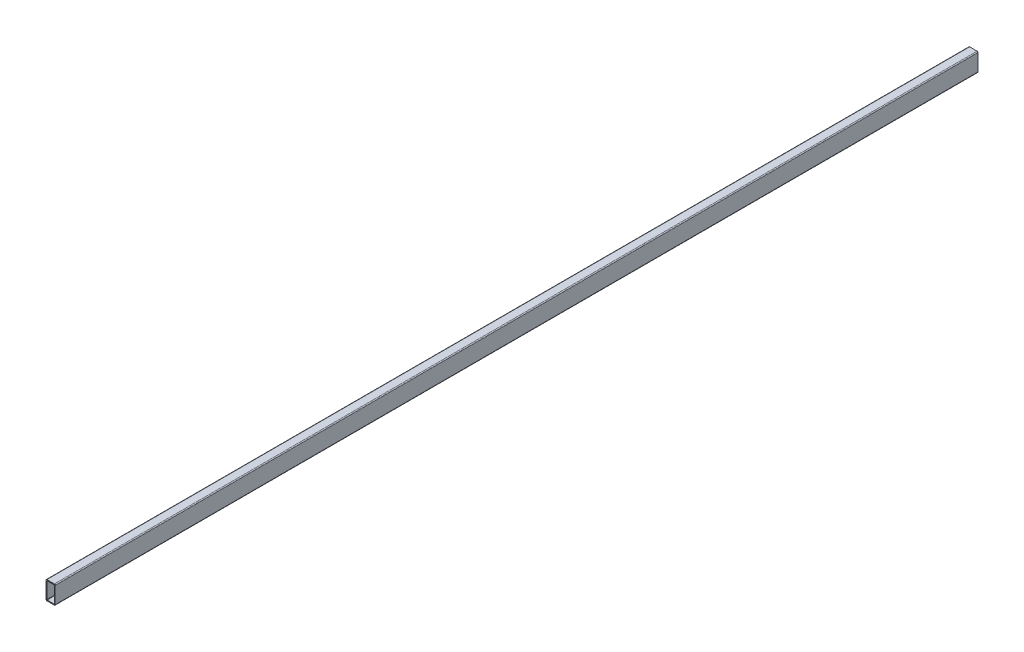
ISO-10303-21;
HEADER;
FILE_DESCRIPTION(('STEP AP214'),'2;1');
FILE_NAME('part.step','',(''),(''),'','','');
FILE_SCHEMA(('AUTOMOTIVE_DESIGN { 1 0 10303 214 1 1 1 1 }'));
ENDSEC;
DATA;
#1=APPLICATION_CONTEXT('core data for automotive mechanical design processes');
#2=APPLICATION_PROTOCOL_DEFINITION('international standard','automotive_design',2000,#1);
#3=PRODUCT_CONTEXT('',#1,'mechanical');
#4=PRODUCT('Part','Part','',(#3));
#5=PRODUCT_RELATED_PRODUCT_CATEGORY('part','',(#4));
#6=PRODUCT_DEFINITION_FORMATION('','',#4);
#7=PRODUCT_DEFINITION_CONTEXT('part definition',#1,'design');
#8=PRODUCT_DEFINITION('design','',#6,#7);
#9=PRODUCT_DEFINITION_SHAPE('','',#8);
#10=(LENGTH_UNIT() NAMED_UNIT(*) SI_UNIT(.MILLI.,.METRE.));
#11=(NAMED_UNIT(*) PLANE_ANGLE_UNIT() SI_UNIT($,.RADIAN.));
#12=(NAMED_UNIT(*) SI_UNIT($,.STERADIAN.) SOLID_ANGLE_UNIT());
#13=UNCERTAINTY_MEASURE_WITH_UNIT(LENGTH_MEASURE(1.E-05),#10,'distance_accuracy_value','');
#14=(GEOMETRIC_REPRESENTATION_CONTEXT(3) GLOBAL_UNCERTAINTY_ASSIGNED_CONTEXT((#13)) GLOBAL_UNIT_ASSIGNED_CONTEXT((#10,
#11,#12)) REPRESENTATION_CONTEXT('',''));
#15=CARTESIAN_POINT('',(0.,0.,0.));
#16=DIRECTION('',(0.,0.,1.));
#17=DIRECTION('',(1.,0.,0.));
#18=AXIS2_PLACEMENT_3D('',#15,#16,#17);
#19=CARTESIAN_POINT('',(15.8031491490571,27.,-3000.));
#20=DIRECTION('',(0.,0.,1.));
#21=DIRECTION('',(1.,0.,0.));
#22=AXIS2_PLACEMENT_3D('',#19,#20,#21);
#23=CYLINDRICAL_SURFACE('',#22,3.);
#24=CARTESIAN_POINT('',(15.8031491490571,27.,0.));
#25=DIRECTION('',(0.,0.,1.));
#26=DIRECTION('',(-1.,0.,0.));
#27=AXIS2_PLACEMENT_3D('',#24,#25,#26);
#28=CIRCLE('',#27,3.);
#29=CARTESIAN_POINT('',(18.8031491490571,27.,0.));
#30=VERTEX_POINT('',#29);
#31=CARTESIAN_POINT('',(15.8031491490571,30.,0.));
#32=VERTEX_POINT('',#31);
#33=EDGE_CURVE('E240',#30,#32,#28,.T.);
#34=ORIENTED_EDGE('',*,*,#33,.F.);
#35=DIRECTION('',(0.,0.,1.));
#36=VECTOR('',#35,1.);
#37=CARTESIAN_POINT('',(18.8031491490571,27.,-3000.));
#38=LINE('',#37,#36);
#39=CARTESIAN_POINT('',(18.8031491490571,27.,-3000.));
#40=VERTEX_POINT('',#39);
#41=EDGE_CURVE('E13',#40,#30,#38,.T.);
#42=ORIENTED_EDGE('',*,*,#41,.F.);
#43=CARTESIAN_POINT('',(15.8031491490571,27.,-3000.));
#44=DIRECTION('',(0.,0.,1.));
#45=DIRECTION('',(-1.,0.,0.));
#46=AXIS2_PLACEMENT_3D('',#43,#44,#45);
#47=CIRCLE('',#46,3.);
#48=CARTESIAN_POINT('',(15.8031491490571,30.,-3000.));
#49=VERTEX_POINT('',#48);
#50=EDGE_CURVE('E258',#40,#49,#47,.T.);
#51=ORIENTED_EDGE('',*,*,#50,.T.);
#52=DIRECTION('',(0.,0.,1.));
#53=VECTOR('',#52,1.);
#54=CARTESIAN_POINT('',(15.8031491490571,30.,-3000.));
#55=LINE('',#54,#53);
#56=EDGE_CURVE('E53',#49,#32,#55,.T.);
#57=ORIENTED_EDGE('',*,*,#56,.T.);
#58=EDGE_LOOP('',(#34,#42,#51,#57));
#59=FACE_BOUND('',#58,.T.);
#60=ADVANCED_FACE('F50',(#59),#23,.T.);
#61=CARTESIAN_POINT('',(18.8031491490571,-27.,-3000.));
#62=DIRECTION('',(1.,0.,0.));
#63=DIRECTION('',(0.,0.,-1.));
#64=AXIS2_PLACEMENT_3D('',#61,#62,#63);
#65=PLANE('',#64);
#66=DIRECTION('',(0.,1.,0.));
#67=VECTOR('',#66,1.);
#68=CARTESIAN_POINT('',(18.8031491490571,-27.,0.));
#69=LINE('',#68,#67);
#70=CARTESIAN_POINT('',(18.8031491490571,-27.,0.));
#71=VERTEX_POINT('',#70);
#72=EDGE_CURVE('E263',#71,#30,#69,.T.);
#73=ORIENTED_EDGE('',*,*,#72,.F.);
#74=DIRECTION('',(0.,0.,1.));
#75=VECTOR('',#74,1.);
#76=CARTESIAN_POINT('',(18.8031491490571,-27.,-3000.));
#77=LINE('',#76,#75);
#78=CARTESIAN_POINT('',(18.8031491490571,-27.,-3000.));
#79=VERTEX_POINT('',#78);
#80=EDGE_CURVE('E59',#79,#71,#77,.T.);
#81=ORIENTED_EDGE('',*,*,#80,.F.);
#82=DIRECTION('',(0.,1.,0.));
#83=VECTOR('',#82,1.);
#84=CARTESIAN_POINT('',(18.8031491490571,-27.,-3000.));
#85=LINE('',#84,#83);
#86=EDGE_CURVE('E287',#79,#40,#85,.T.);
#87=ORIENTED_EDGE('',*,*,#86,.T.);
#88=ORIENTED_EDGE('',*,*,#41,.T.);
#89=EDGE_LOOP('',(#73,#81,#87,#88));
#90=FACE_BOUND('',#89,.T.);
#91=ADVANCED_FACE('F352',(#90),#65,.T.);
#92=CARTESIAN_POINT('',(15.8031491490571,-27.,-3000.));
#93=DIRECTION('',(0.,0.,1.));
#94=DIRECTION('',(1.,0.,0.));
#95=AXIS2_PLACEMENT_3D('',#92,#93,#94);
#96=CYLINDRICAL_SURFACE('',#95,3.);
#97=CARTESIAN_POINT('',(15.8031491490571,-27.,0.));
#98=DIRECTION('',(0.,0.,1.));
#99=DIRECTION('',(-1.,0.,0.));
#100=AXIS2_PLACEMENT_3D('',#97,#98,#99);
#101=CIRCLE('',#100,3.);
#102=CARTESIAN_POINT('',(15.8031491490571,-30.,0.));
#103=VERTEX_POINT('',#102);
#104=EDGE_CURVE('E314',#103,#71,#101,.T.);
#105=ORIENTED_EDGE('',*,*,#104,.F.);
#106=DIRECTION('',(0.,0.,1.));
#107=VECTOR('',#106,1.);
#108=CARTESIAN_POINT('',(15.8031491490571,-30.,-3000.));
#109=LINE('',#108,#107);
#110=CARTESIAN_POINT('',(15.8031491490571,-30.,-3000.));
#111=VERTEX_POINT('',#110);
#112=EDGE_CURVE('E323',#111,#103,#109,.T.);
#113=ORIENTED_EDGE('',*,*,#112,.F.);
#114=CARTESIAN_POINT('',(15.8031491490571,-27.,-3000.));
#115=DIRECTION('',(0.,0.,1.));
#116=DIRECTION('',(-1.,0.,0.));
#117=AXIS2_PLACEMENT_3D('',#114,#115,#116);
#118=CIRCLE('',#117,3.);
#119=EDGE_CURVE('E283',#111,#79,#118,.T.);
#120=ORIENTED_EDGE('',*,*,#119,.T.);
#121=ORIENTED_EDGE('',*,*,#80,.T.);
#122=EDGE_LOOP('',(#105,#113,#120,#121));
#123=FACE_BOUND('',#122,.T.);
#124=ADVANCED_FACE('F371',(#123),#96,.T.);
#125=CARTESIAN_POINT('',(-8.19685085094295,-30.,-3000.));
#126=DIRECTION('',(0.,-1.,0.));
#127=DIRECTION('',(1.,0.,0.));
#128=AXIS2_PLACEMENT_3D('',#125,#126,#127);
#129=PLANE('',#128);
#130=DIRECTION('',(1.,0.,0.));
#131=VECTOR('',#130,1.);
#132=CARTESIAN_POINT('',(-8.19685085094295,-30.,0.));
#133=LINE('',#132,#131);
#134=CARTESIAN_POINT('',(-8.19685085094295,-30.,0.));
#135=VERTEX_POINT('',#134);
#136=EDGE_CURVE('E310',#135,#103,#133,.T.);
#137=ORIENTED_EDGE('',*,*,#136,.F.);
#138=DIRECTION('',(0.,0.,1.));
#139=VECTOR('',#138,1.);
#140=CARTESIAN_POINT('',(-8.19685085094295,-30.,-3000.));
#141=LINE('',#140,#139);
#142=CARTESIAN_POINT('',(-8.19685085094295,-30.,-3000.));
#143=VERTEX_POINT('',#142);
#144=EDGE_CURVE('E326',#143,#135,#141,.T.);
#145=ORIENTED_EDGE('',*,*,#144,.F.);
#146=DIRECTION('',(1.,0.,0.));
#147=VECTOR('',#146,1.);
#148=CARTESIAN_POINT('',(-8.19685085094295,-30.,-3000.));
#149=LINE('',#148,#147);
#150=EDGE_CURVE('E279',#143,#111,#149,.T.);
#151=ORIENTED_EDGE('',*,*,#150,.T.);
#152=ORIENTED_EDGE('',*,*,#112,.T.);
#153=EDGE_LOOP('',(#137,#145,#151,#152));
#154=FACE_BOUND('',#153,.T.);
#155=ADVANCED_FACE('F369',(#154),#129,.T.);
#156=CARTESIAN_POINT('',(-8.19685085094295,-27.,-3000.));
#157=DIRECTION('',(0.,0.,1.));
#158=DIRECTION('',(1.,0.,0.));
#159=AXIS2_PLACEMENT_3D('',#156,#157,#158);
#160=CYLINDRICAL_SURFACE('',#159,3.);
#161=CARTESIAN_POINT('',(-8.19685085094295,-27.,0.));
#162=DIRECTION('',(0.,0.,1.));
#163=DIRECTION('',(-1.,0.,0.));
#164=AXIS2_PLACEMENT_3D('',#161,#162,#163);
#165=CIRCLE('',#164,3.);
#166=CARTESIAN_POINT('',(-11.1968508509429,-27.,0.));
#167=VERTEX_POINT('',#166);
#168=EDGE_CURVE('E306',#167,#135,#165,.T.);
#169=ORIENTED_EDGE('',*,*,#168,.F.);
#170=DIRECTION('',(0.,0.,1.));
#171=VECTOR('',#170,1.);
#172=CARTESIAN_POINT('',(-11.1968508509429,-27.,-3000.));
#173=LINE('',#172,#171);
#174=CARTESIAN_POINT('',(-11.1968508509429,-27.,-3000.));
#175=VERTEX_POINT('',#174);
#176=EDGE_CURVE('E329',#175,#167,#173,.T.);
#177=ORIENTED_EDGE('',*,*,#176,.F.);
#178=CARTESIAN_POINT('',(-8.19685085094295,-27.,-3000.));
#179=DIRECTION('',(0.,0.,1.));
#180=DIRECTION('',(-1.,0.,0.));
#181=AXIS2_PLACEMENT_3D('',#178,#179,#180);
#182=CIRCLE('',#181,3.);
#183=EDGE_CURVE('E275',#175,#143,#182,.T.);
#184=ORIENTED_EDGE('',*,*,#183,.T.);
#185=ORIENTED_EDGE('',*,*,#144,.T.);
#186=EDGE_LOOP('',(#169,#177,#184,#185));
#187=FACE_BOUND('',#186,.T.);
#188=ADVANCED_FACE('F365',(#187),#160,.T.);
#189=CARTESIAN_POINT('',(-11.1968508509429,-27.,-3000.));
#190=DIRECTION('',(-1.,0.,0.));
#191=DIRECTION('',(0.,0.,1.));
#192=AXIS2_PLACEMENT_3D('',#189,#190,#191);
#193=PLANE('',#192);
#194=DIRECTION('',(0.,-1.,0.));
#195=VECTOR('',#194,1.);
#196=CARTESIAN_POINT('',(-11.1968508509429,-27.,0.));
#197=LINE('',#196,#195);
#198=CARTESIAN_POINT('',(-11.1968508509429,27.,0.));
#199=VERTEX_POINT('',#198);
#200=EDGE_CURVE('E302',#199,#167,#197,.T.);
#201=ORIENTED_EDGE('',*,*,#200,.F.);
#202=DIRECTION('',(0.,0.,1.));
#203=VECTOR('',#202,1.);
#204=CARTESIAN_POINT('',(-11.1968508509429,27.,-3000.));
#205=LINE('',#204,#203);
#206=CARTESIAN_POINT('',(-11.1968508509429,27.,-3000.));
#207=VERTEX_POINT('',#206);
#208=EDGE_CURVE('E332',#207,#199,#205,.T.);
#209=ORIENTED_EDGE('',*,*,#208,.F.);
#210=DIRECTION('',(0.,-1.,0.));
#211=VECTOR('',#210,1.);
#212=CARTESIAN_POINT('',(-11.1968508509429,-27.,-3000.));
#213=LINE('',#212,#211);
#214=EDGE_CURVE('E271',#207,#175,#213,.T.);
#215=ORIENTED_EDGE('',*,*,#214,.T.);
#216=ORIENTED_EDGE('',*,*,#176,.T.);
#217=EDGE_LOOP('',(#201,#209,#215,#216));
#218=FACE_BOUND('',#217,.T.);
#219=ADVANCED_FACE('F363',(#218),#193,.T.);
#220=CARTESIAN_POINT('',(-8.19685085094295,27.,-3000.));
#221=DIRECTION('',(0.,0.,1.));
#222=DIRECTION('',(1.,0.,0.));
#223=AXIS2_PLACEMENT_3D('',#220,#221,#222);
#224=CYLINDRICAL_SURFACE('',#223,3.);
#225=CARTESIAN_POINT('',(-8.19685085094295,27.,0.));
#226=DIRECTION('',(0.,0.,1.));
#227=DIRECTION('',(-1.,0.,0.));
#228=AXIS2_PLACEMENT_3D('',#225,#226,#227);
#229=CIRCLE('',#228,3.);
#230=CARTESIAN_POINT('',(-8.19685085094295,30.,0.));
#231=VERTEX_POINT('',#230);
#232=EDGE_CURVE('E298',#231,#199,#229,.T.);
#233=ORIENTED_EDGE('',*,*,#232,.F.);
#234=DIRECTION('',(0.,0.,1.));
#235=VECTOR('',#234,1.);
#236=CARTESIAN_POINT('',(-8.19685085094295,30.,-3000.));
#237=LINE('',#236,#235);
#238=CARTESIAN_POINT('',(-8.19685085094295,30.,-3000.));
#239=VERTEX_POINT('',#238);
#240=EDGE_CURVE('E334',#239,#231,#237,.T.);
#241=ORIENTED_EDGE('',*,*,#240,.F.);
#242=CARTESIAN_POINT('',(-8.19685085094295,27.,-3000.));
#243=DIRECTION('',(0.,0.,1.));
#244=DIRECTION('',(-1.,0.,0.));
#245=AXIS2_PLACEMENT_3D('',#242,#243,#244);
#246=CIRCLE('',#245,3.);
#247=EDGE_CURVE('E267',#239,#207,#246,.T.);
#248=ORIENTED_EDGE('',*,*,#247,.T.);
#249=ORIENTED_EDGE('',*,*,#208,.T.);
#250=EDGE_LOOP('',(#233,#241,#248,#249));
#251=FACE_BOUND('',#250,.T.);
#252=ADVANCED_FACE('F359',(#251),#224,.T.);
#253=CARTESIAN_POINT('',(-8.19685085094295,30.,-3000.));
#254=DIRECTION('',(0.,1.,0.));
#255=DIRECTION('',(-1.,0.,0.));
#256=AXIS2_PLACEMENT_3D('',#253,#254,#255);
#257=PLANE('',#256);
#258=DIRECTION('',(-1.,0.,0.));
#259=VECTOR('',#258,1.);
#260=CARTESIAN_POINT('',(-8.19685085094295,30.,0.));
#261=LINE('',#260,#259);
#262=EDGE_CURVE('E294',#32,#231,#261,.T.);
#263=ORIENTED_EDGE('',*,*,#262,.F.);
#264=ORIENTED_EDGE('',*,*,#56,.F.);
#265=DIRECTION('',(-1.,0.,0.));
#266=VECTOR('',#265,1.);
#267=CARTESIAN_POINT('',(-8.19685085094295,30.,-3000.));
#268=LINE('',#267,#266);
#269=EDGE_CURVE('E262',#49,#239,#268,.T.);
#270=ORIENTED_EDGE('',*,*,#269,.T.);
#271=ORIENTED_EDGE('',*,*,#240,.T.);
#272=EDGE_LOOP('',(#263,#264,#270,#271));
#273=FACE_BOUND('',#272,.T.);
#274=ADVANCED_FACE('F346',(#273),#257,.T.);
#275=CARTESIAN_POINT('',(15.8031491490571,27.,-3000.));
#276=DIRECTION('',(0.,0.,-1.));
#277=DIRECTION('',(-1.,0.,0.));
#278=AXIS2_PLACEMENT_3D('',#275,#276,#277);
#279=PLANE('',#278);
#280=CARTESIAN_POINT('',(14.8031491490571,26.,-3000.));
#281=DIRECTION('',(0.,0.,1.));
#282=DIRECTION('',(-1.,0.,0.));
#283=AXIS2_PLACEMENT_3D('',#280,#281,#282);
#284=CIRCLE('',#283,1.);
#285=CARTESIAN_POINT('',(15.8031491490571,26.,-3000.));
#286=VERTEX_POINT('',#285);
#287=CARTESIAN_POINT('',(14.8031491490571,27.,-3000.));
#288=VERTEX_POINT('',#287);
#289=EDGE_CURVE('E166',#286,#288,#284,.T.);
#290=ORIENTED_EDGE('',*,*,#289,.T.);
#291=DIRECTION('',(-1.,0.,0.));
#292=VECTOR('',#291,1.);
#293=CARTESIAN_POINT('',(-7.19685085094295,27.,-3000.));
#294=LINE('',#293,#292);
#295=CARTESIAN_POINT('',(-7.19685085094295,27.,-3000.));
#296=VERTEX_POINT('',#295);
#297=EDGE_CURVE('E176',#288,#296,#294,.T.);
#298=ORIENTED_EDGE('',*,*,#297,.T.);
#299=CARTESIAN_POINT('',(-7.19685085094295,26.,-3000.));
#300=DIRECTION('',(0.,0.,1.));
#301=DIRECTION('',(-1.,0.,0.));
#302=AXIS2_PLACEMENT_3D('',#299,#300,#301);
#303=CIRCLE('',#302,0.999999999999997);
#304=CARTESIAN_POINT('',(-8.19685085094294,26.,-3000.));
#305=VERTEX_POINT('',#304);
#306=EDGE_CURVE('E67',#296,#305,#303,.T.);
#307=ORIENTED_EDGE('',*,*,#306,.T.);
#308=DIRECTION('',(0.,-1.,0.));
#309=VECTOR('',#308,1.);
#310=CARTESIAN_POINT('',(-8.19685085094295,-26.,-3000.));
#311=LINE('',#310,#309);
#312=CARTESIAN_POINT('',(-8.19685085094295,-26.,-3000.));
#313=VERTEX_POINT('',#312);
#314=EDGE_CURVE('E196',#305,#313,#311,.T.);
#315=ORIENTED_EDGE('',*,*,#314,.T.);
#316=CARTESIAN_POINT('',(-7.19685085094295,-26.,-3000.));
#317=DIRECTION('',(0.,0.,1.));
#318=DIRECTION('',(-1.,0.,0.));
#319=AXIS2_PLACEMENT_3D('',#316,#317,#318);
#320=CIRCLE('',#319,0.999999999999999);
#321=CARTESIAN_POINT('',(-7.19685085094295,-27.,-3000.));
#322=VERTEX_POINT('',#321);
#323=EDGE_CURVE('E200',#313,#322,#320,.T.);
#324=ORIENTED_EDGE('',*,*,#323,.T.);
#325=DIRECTION('',(1.,0.,0.));
#326=VECTOR('',#325,1.);
#327=CARTESIAN_POINT('',(-7.19685085094295,-27.,-3000.));
#328=LINE('',#327,#326);
#329=CARTESIAN_POINT('',(14.8031491490571,-27.,-3000.));
#330=VERTEX_POINT('',#329);
#331=EDGE_CURVE('E204',#322,#330,#328,.T.);
#332=ORIENTED_EDGE('',*,*,#331,.T.);
#333=CARTESIAN_POINT('',(14.8031491490571,-26.,-3000.));
#334=DIRECTION('',(0.,0.,1.));
#335=DIRECTION('',(-1.,0.,0.));
#336=AXIS2_PLACEMENT_3D('',#333,#334,#335);
#337=CIRCLE('',#336,1.);
#338=CARTESIAN_POINT('',(15.8031491490571,-26.,-3000.));
#339=VERTEX_POINT('',#338);
#340=EDGE_CURVE('E208',#330,#339,#337,.T.);
#341=ORIENTED_EDGE('',*,*,#340,.T.);
#342=DIRECTION('',(0.,1.,0.));
#343=VECTOR('',#342,1.);
#344=CARTESIAN_POINT('',(15.8031491490571,-26.,-3000.));
#345=LINE('',#344,#343);
#346=EDGE_CURVE('E173',#339,#286,#345,.T.);
#347=ORIENTED_EDGE('',*,*,#346,.T.);
#348=EDGE_LOOP('',(#290,#298,#307,#315,#324,#332,#341,#347));
#349=FACE_BOUND('',#348,.T.);
#350=ORIENTED_EDGE('',*,*,#50,.F.);
#351=ORIENTED_EDGE('',*,*,#86,.F.);
#352=ORIENTED_EDGE('',*,*,#119,.F.);
#353=ORIENTED_EDGE('',*,*,#150,.F.);
#354=ORIENTED_EDGE('',*,*,#183,.F.);
#355=ORIENTED_EDGE('',*,*,#214,.F.);
#356=ORIENTED_EDGE('',*,*,#247,.F.);
#357=ORIENTED_EDGE('',*,*,#269,.F.);
#358=EDGE_LOOP('',(#350,#351,#352,#353,#354,#355,#356,#357));
#359=FACE_BOUND('',#358,.T.);
#360=ADVANCED_FACE('F181',(#349,#359),#279,.T.);
#361=CARTESIAN_POINT('',(15.8031491490571,27.,0.));
#362=DIRECTION('',(0.,0.,-1.));
#363=DIRECTION('',(-1.,0.,0.));
#364=AXIS2_PLACEMENT_3D('',#361,#362,#363);
#365=PLANE('',#364);
#366=DIRECTION('',(-1.,0.,0.));
#367=VECTOR('',#366,1.);
#368=CARTESIAN_POINT('',(-7.19685085094295,27.,0.));
#369=LINE('',#368,#367);
#370=CARTESIAN_POINT('',(14.8031491490571,27.,0.));
#371=VERTEX_POINT('',#370);
#372=CARTESIAN_POINT('',(-7.19685085094295,27.,0.));
#373=VERTEX_POINT('',#372);
#374=EDGE_CURVE('E215',#371,#373,#369,.T.);
#375=ORIENTED_EDGE('',*,*,#374,.F.);
#376=CARTESIAN_POINT('',(14.8031491490571,26.,0.));
#377=DIRECTION('',(0.,0.,1.));
#378=DIRECTION('',(-1.,0.,0.));
#379=AXIS2_PLACEMENT_3D('',#376,#377,#378);
#380=CIRCLE('',#379,1.);
#381=CARTESIAN_POINT('',(15.8031491490571,26.,0.));
#382=VERTEX_POINT('',#381);
#383=EDGE_CURVE('E75',#382,#371,#380,.T.);
#384=ORIENTED_EDGE('',*,*,#383,.F.);
#385=DIRECTION('',(0.,1.,0.));
#386=VECTOR('',#385,1.);
#387=CARTESIAN_POINT('',(15.8031491490571,-26.,0.));
#388=LINE('',#387,#386);
#389=CARTESIAN_POINT('',(15.8031491490571,-26.,0.));
#390=VERTEX_POINT('',#389);
#391=EDGE_CURVE('E186',#390,#382,#388,.T.);
#392=ORIENTED_EDGE('',*,*,#391,.F.);
#393=CARTESIAN_POINT('',(14.8031491490571,-26.,0.));
#394=DIRECTION('',(0.,0.,1.));
#395=DIRECTION('',(-1.,0.,0.));
#396=AXIS2_PLACEMENT_3D('',#393,#394,#395);
#397=CIRCLE('',#396,1.);
#398=CARTESIAN_POINT('',(14.8031491490571,-27.,0.));
#399=VERTEX_POINT('',#398);
#400=EDGE_CURVE('E191',#399,#390,#397,.T.);
#401=ORIENTED_EDGE('',*,*,#400,.F.);
#402=DIRECTION('',(1.,0.,0.));
#403=VECTOR('',#402,1.);
#404=CARTESIAN_POINT('',(-7.19685085094295,-27.,0.));
#405=LINE('',#404,#403);
#406=CARTESIAN_POINT('',(-7.19685085094295,-27.,0.));
#407=VERTEX_POINT('',#406);
#408=EDGE_CURVE('E230',#407,#399,#405,.T.);
#409=ORIENTED_EDGE('',*,*,#408,.F.);
#410=CARTESIAN_POINT('',(-7.19685085094295,-26.,0.));
#411=DIRECTION('',(0.,0.,1.));
#412=DIRECTION('',(-1.,0.,0.));
#413=AXIS2_PLACEMENT_3D('',#410,#411,#412);
#414=CIRCLE('',#413,0.999999999999999);
#415=CARTESIAN_POINT('',(-8.19685085094295,-26.,0.));
#416=VERTEX_POINT('',#415);
#417=EDGE_CURVE('E226',#416,#407,#414,.T.);
#418=ORIENTED_EDGE('',*,*,#417,.F.);
#419=DIRECTION('',(0.,-1.,0.));
#420=VECTOR('',#419,1.);
#421=CARTESIAN_POINT('',(-8.19685085094295,-26.,0.));
#422=LINE('',#421,#420);
#423=CARTESIAN_POINT('',(-8.19685085094294,26.,0.));
#424=VERTEX_POINT('',#423);
#425=EDGE_CURVE('E222',#424,#416,#422,.T.);
#426=ORIENTED_EDGE('',*,*,#425,.F.);
#427=CARTESIAN_POINT('',(-7.19685085094295,26.,0.));
#428=DIRECTION('',(0.,0.,1.));
#429=DIRECTION('',(-1.,0.,0.));
#430=AXIS2_PLACEMENT_3D('',#427,#428,#429);
#431=CIRCLE('',#430,0.999999999999997);
#432=EDGE_CURVE('E218',#373,#424,#431,.T.);
#433=ORIENTED_EDGE('',*,*,#432,.F.);
#434=EDGE_LOOP('',(#375,#384,#392,#401,#409,#418,#426,#433));
#435=FACE_BOUND('',#434,.T.);
#436=ORIENTED_EDGE('',*,*,#33,.T.);
#437=ORIENTED_EDGE('',*,*,#262,.T.);
#438=ORIENTED_EDGE('',*,*,#232,.T.);
#439=ORIENTED_EDGE('',*,*,#200,.T.);
#440=ORIENTED_EDGE('',*,*,#168,.T.);
#441=ORIENTED_EDGE('',*,*,#136,.T.);
#442=ORIENTED_EDGE('',*,*,#104,.T.);
#443=ORIENTED_EDGE('',*,*,#72,.T.);
#444=EDGE_LOOP('',(#436,#437,#438,#439,#440,#441,#442,#443));
#445=FACE_BOUND('',#444,.T.);
#446=ADVANCED_FACE('F348',(#435,#445),#365,.F.);
#447=CARTESIAN_POINT('',(14.8031491490571,26.,-3000.));
#448=DIRECTION('',(0.,0.,1.));
#449=DIRECTION('',(1.,0.,0.));
#450=AXIS2_PLACEMENT_3D('',#447,#448,#449);
#451=CYLINDRICAL_SURFACE('',#450,1.);
#452=ORIENTED_EDGE('',*,*,#383,.T.);
#453=DIRECTION('',(0.,0.,1.));
#454=VECTOR('',#453,1.);
#455=CARTESIAN_POINT('',(14.8031491490571,27.,-3000.));
#456=LINE('',#455,#454);
#457=EDGE_CURVE('E162',#288,#371,#456,.T.);
#458=ORIENTED_EDGE('',*,*,#457,.F.);
#459=ORIENTED_EDGE('',*,*,#289,.F.);
#460=DIRECTION('',(0.,0.,1.));
#461=VECTOR('',#460,1.);
#462=CARTESIAN_POINT('',(15.8031491490571,26.,-3000.));
#463=LINE('',#462,#461);
#464=EDGE_CURVE('E237',#286,#382,#463,.T.);
#465=ORIENTED_EDGE('',*,*,#464,.T.);
#466=EDGE_LOOP('',(#452,#458,#459,#465));
#467=FACE_BOUND('',#466,.T.);
#468=ADVANCED_FACE('F164',(#467),#451,.F.);
#469=CARTESIAN_POINT('',(15.8031491490571,-26.,-3000.));
#470=DIRECTION('',(1.,0.,0.));
#471=DIRECTION('',(0.,0.,-1.));
#472=AXIS2_PLACEMENT_3D('',#469,#470,#471);
#473=PLANE('',#472);
#474=ORIENTED_EDGE('',*,*,#391,.T.);
#475=ORIENTED_EDGE('',*,*,#464,.F.);
#476=ORIENTED_EDGE('',*,*,#346,.F.);
#477=DIRECTION('',(0.,0.,1.));
#478=VECTOR('',#477,1.);
#479=CARTESIAN_POINT('',(15.8031491490571,-26.,-3000.));
#480=LINE('',#479,#478);
#481=EDGE_CURVE('E241',#339,#390,#480,.T.);
#482=ORIENTED_EDGE('',*,*,#481,.T.);
#483=EDGE_LOOP('',(#474,#475,#476,#482));
#484=FACE_BOUND('',#483,.T.);
#485=ADVANCED_FACE('F454',(#484),#473,.F.);
#486=CARTESIAN_POINT('',(14.8031491490571,-26.,-3000.));
#487=DIRECTION('',(0.,0.,1.));
#488=DIRECTION('',(1.,0.,0.));
#489=AXIS2_PLACEMENT_3D('',#486,#487,#488);
#490=CYLINDRICAL_SURFACE('',#489,1.);
#491=ORIENTED_EDGE('',*,*,#400,.T.);
#492=ORIENTED_EDGE('',*,*,#481,.F.);
#493=ORIENTED_EDGE('',*,*,#340,.F.);
#494=DIRECTION('',(0.,0.,1.));
#495=VECTOR('',#494,1.);
#496=CARTESIAN_POINT('',(14.8031491490571,-27.,-3000.));
#497=LINE('',#496,#495);
#498=EDGE_CURVE('E244',#330,#399,#497,.T.);
#499=ORIENTED_EDGE('',*,*,#498,.T.);
#500=EDGE_LOOP('',(#491,#492,#493,#499));
#501=FACE_BOUND('',#500,.T.);
#502=ADVANCED_FACE('F463',(#501),#490,.F.);
#503=CARTESIAN_POINT('',(-7.19685085094295,-27.,-3000.));
#504=DIRECTION('',(0.,-1.,0.));
#505=DIRECTION('',(0.,0.,-1.));
#506=AXIS2_PLACEMENT_3D('',#503,#504,#505);
#507=PLANE('',#506);
#508=ORIENTED_EDGE('',*,*,#408,.T.);
#509=ORIENTED_EDGE('',*,*,#498,.F.);
#510=ORIENTED_EDGE('',*,*,#331,.F.);
#511=DIRECTION('',(0.,0.,1.));
#512=VECTOR('',#511,1.);
#513=CARTESIAN_POINT('',(-7.19685085094295,-27.,-3000.));
#514=LINE('',#513,#512);
#515=EDGE_CURVE('E247',#322,#407,#514,.T.);
#516=ORIENTED_EDGE('',*,*,#515,.T.);
#517=EDGE_LOOP('',(#508,#509,#510,#516));
#518=FACE_BOUND('',#517,.T.);
#519=ADVANCED_FACE('F473',(#518),#507,.F.);
#520=CARTESIAN_POINT('',(-7.19685085094295,-26.,-3000.));
#521=DIRECTION('',(0.,0.,1.));
#522=DIRECTION('',(1.,0.,0.));
#523=AXIS2_PLACEMENT_3D('',#520,#521,#522);
#524=CYLINDRICAL_SURFACE('',#523,0.999999999999999);
#525=ORIENTED_EDGE('',*,*,#417,.T.);
#526=ORIENTED_EDGE('',*,*,#515,.F.);
#527=ORIENTED_EDGE('',*,*,#323,.F.);
#528=DIRECTION('',(0.,0.,1.));
#529=VECTOR('',#528,1.);
#530=CARTESIAN_POINT('',(-8.19685085094295,-26.,-3000.));
#531=LINE('',#530,#529);
#532=EDGE_CURVE('E250',#313,#416,#531,.T.);
#533=ORIENTED_EDGE('',*,*,#532,.T.);
#534=EDGE_LOOP('',(#525,#526,#527,#533));
#535=FACE_BOUND('',#534,.T.);
#536=ADVANCED_FACE('F483',(#535),#524,.F.);
#537=CARTESIAN_POINT('',(-8.19685085094295,-26.,-3000.));
#538=DIRECTION('',(-1.,0.,0.));
#539=DIRECTION('',(0.,0.,1.));
#540=AXIS2_PLACEMENT_3D('',#537,#538,#539);
#541=PLANE('',#540);
#542=ORIENTED_EDGE('',*,*,#425,.T.);
#543=ORIENTED_EDGE('',*,*,#532,.F.);
#544=ORIENTED_EDGE('',*,*,#314,.F.);
#545=DIRECTION('',(0.,0.,1.));
#546=VECTOR('',#545,1.);
#547=CARTESIAN_POINT('',(-8.19685085094294,26.,-3000.));
#548=LINE('',#547,#546);
#549=EDGE_CURVE('E253',#305,#424,#548,.T.);
#550=ORIENTED_EDGE('',*,*,#549,.T.);
#551=EDGE_LOOP('',(#542,#543,#544,#550));
#552=FACE_BOUND('',#551,.T.);
#553=ADVANCED_FACE('F493',(#552),#541,.F.);
#554=CARTESIAN_POINT('',(-7.19685085094295,26.,-3000.));
#555=DIRECTION('',(0.,0.,1.));
#556=DIRECTION('',(1.,0.,0.));
#557=AXIS2_PLACEMENT_3D('',#554,#555,#556);
#558=CYLINDRICAL_SURFACE('',#557,0.999999999999997);
#559=ORIENTED_EDGE('',*,*,#432,.T.);
#560=ORIENTED_EDGE('',*,*,#549,.F.);
#561=ORIENTED_EDGE('',*,*,#306,.F.);
#562=DIRECTION('',(0.,0.,1.));
#563=VECTOR('',#562,1.);
#564=CARTESIAN_POINT('',(-7.19685085094295,27.,-3000.));
#565=LINE('',#564,#563);
#566=EDGE_CURVE('E172',#296,#373,#565,.T.);
#567=ORIENTED_EDGE('',*,*,#566,.T.);
#568=EDGE_LOOP('',(#559,#560,#561,#567));
#569=FACE_BOUND('',#568,.T.);
#570=ADVANCED_FACE('F503',(#569),#558,.F.);
#571=CARTESIAN_POINT('',(-7.19685085094295,27.,-3000.));
#572=DIRECTION('',(0.,1.,0.));
#573=DIRECTION('',(0.,0.,1.));
#574=AXIS2_PLACEMENT_3D('',#571,#572,#573);
#575=PLANE('',#574);
#576=ORIENTED_EDGE('',*,*,#374,.T.);
#577=ORIENTED_EDGE('',*,*,#566,.F.);
#578=ORIENTED_EDGE('',*,*,#297,.F.);
#579=ORIENTED_EDGE('',*,*,#457,.T.);
#580=EDGE_LOOP('',(#576,#577,#578,#579));
#581=FACE_BOUND('',#580,.T.);
#582=ADVANCED_FACE('F177',(#581),#575,.F.);
#583=CLOSED_SHELL('',(#60,#91,#124,#155,#188,#219,#252,#274,#360,#446,#468,#485,#502,#519,#536,
#553,#570,#582));
#584=MANIFOLD_SOLID_BREP('B2',#583);
#585=ADVANCED_BREP_SHAPE_REPRESENTATION('',(#18,#584),#14);
#586=SHAPE_DEFINITION_REPRESENTATION(#9,#585);
ENDSEC;
END-ISO-10303-21;
